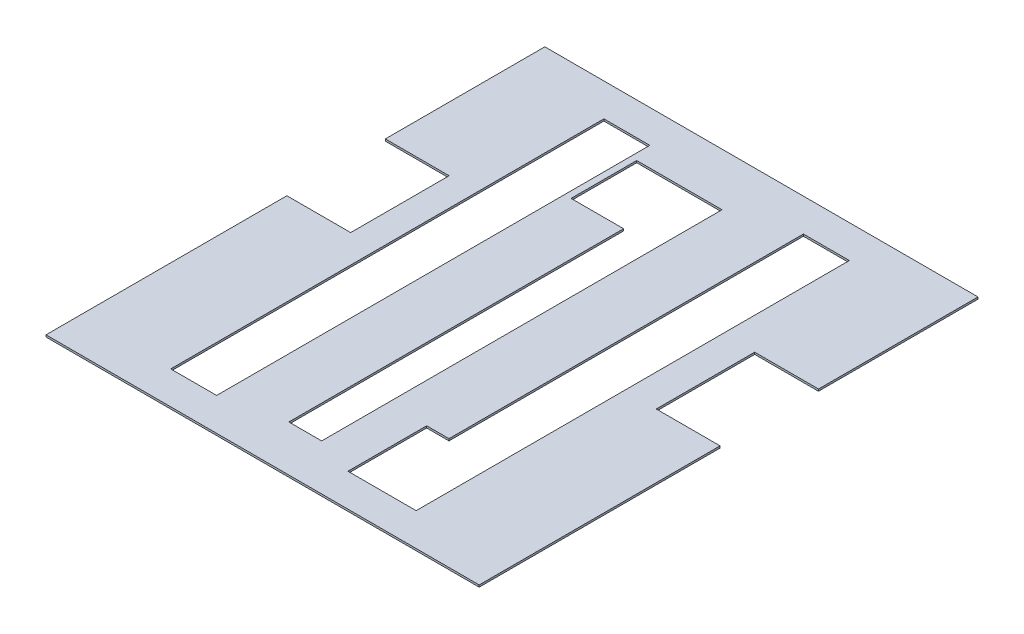
ISO-10303-21;
HEADER;
FILE_DESCRIPTION(('STEP AP214'),'2;1');
FILE_NAME('part.step','',(''),(''),'','','');
FILE_SCHEMA(('AUTOMOTIVE_DESIGN { 1 0 10303 214 1 1 1 1 }'));
ENDSEC;
DATA;
#1=APPLICATION_CONTEXT('core data for automotive mechanical design processes');
#2=APPLICATION_PROTOCOL_DEFINITION('international standard','automotive_design',2000,#1);
#3=PRODUCT_CONTEXT('',#1,'mechanical');
#4=PRODUCT('Part','Part','',(#3));
#5=PRODUCT_RELATED_PRODUCT_CATEGORY('part','',(#4));
#6=PRODUCT_DEFINITION_FORMATION('','',#4);
#7=PRODUCT_DEFINITION_CONTEXT('part definition',#1,'design');
#8=PRODUCT_DEFINITION('design','',#6,#7);
#9=PRODUCT_DEFINITION_SHAPE('','',#8);
#10=(LENGTH_UNIT() NAMED_UNIT(*) SI_UNIT(.MILLI.,.METRE.));
#11=(NAMED_UNIT(*) PLANE_ANGLE_UNIT() SI_UNIT($,.RADIAN.));
#12=(NAMED_UNIT(*) SI_UNIT($,.STERADIAN.) SOLID_ANGLE_UNIT());
#13=UNCERTAINTY_MEASURE_WITH_UNIT(LENGTH_MEASURE(1.E-05),#10,'distance_accuracy_value','');
#14=(GEOMETRIC_REPRESENTATION_CONTEXT(3) GLOBAL_UNCERTAINTY_ASSIGNED_CONTEXT((#13)) GLOBAL_UNIT_ASSIGNED_CONTEXT((#10,
#11,#12)) REPRESENTATION_CONTEXT('',''));
#15=CARTESIAN_POINT('',(0.,0.,0.));
#16=DIRECTION('',(0.,0.,1.));
#17=DIRECTION('',(1.,0.,0.));
#18=AXIS2_PLACEMENT_3D('',#15,#16,#17);
#19=CARTESIAN_POINT('',(6011.08406699949,1.5,8572.31237778607));
#20=DIRECTION('',(1.,0.,0.));
#21=DIRECTION('',(0.,0.,-1.));
#22=AXIS2_PLACEMENT_3D('',#19,#20,#21);
#23=PLANE('',#22);
#24=DIRECTION('',(0.,0.,1.));
#25=VECTOR('',#24,1.);
#26=CARTESIAN_POINT('',(6011.08406699949,1.5,8572.31237778607));
#27=LINE('',#26,#25);
#28=CARTESIAN_POINT('',(6011.08406699949,1.5,8768.81237778607));
#29=VERTEX_POINT('',#28);
#30=CARTESIAN_POINT('',(6011.08406699949,1.5,8952.31237778607));
#31=VERTEX_POINT('',#30);
#32=EDGE_CURVE('E341',#29,#31,#27,.T.);
#33=ORIENTED_EDGE('',*,*,#32,.F.);
#34=DIRECTION('',(0.,1.,0.));
#35=VECTOR('',#34,1.);
#36=CARTESIAN_POINT('',(6011.08406699949,-8.5,8768.81237778607));
#37=LINE('',#36,#35);
#38=CARTESIAN_POINT('',(6011.08406699949,0.,8768.81237778607));
#39=VERTEX_POINT('',#38);
#40=EDGE_CURVE('E316',#39,#29,#37,.T.);
#41=ORIENTED_EDGE('',*,*,#40,.F.);
#42=DIRECTION('',(0.,0.,1.));
#43=VECTOR('',#42,1.);
#44=CARTESIAN_POINT('',(6011.08406699949,0.,8572.31237778607));
#45=LINE('',#44,#43);
#46=CARTESIAN_POINT('',(6011.08406699949,0.,8952.31237778607));
#47=VERTEX_POINT('',#46);
#48=EDGE_CURVE('E315',#39,#47,#45,.T.);
#49=ORIENTED_EDGE('',*,*,#48,.T.);
#50=DIRECTION('',(0.,-1.,0.));
#51=VECTOR('',#50,1.);
#52=CARTESIAN_POINT('',(6011.08406699949,1.5,8952.31237778607));
#53=LINE('',#52,#51);
#54=EDGE_CURVE('E369',#31,#47,#53,.T.);
#55=ORIENTED_EDGE('',*,*,#54,.F.);
#56=EDGE_LOOP('',(#33,#41,#49,#55));
#57=FACE_BOUND('',#56,.T.);
#58=ADVANCED_FACE('F33',(#57),#23,.F.);
#59=CARTESIAN_POINT('',(6341.08406699949,1.5,8572.31237778607));
#60=DIRECTION('',(-1.,0.,0.));
#61=DIRECTION('',(0.,0.,1.));
#62=AXIS2_PLACEMENT_3D('',#59,#60,#61);
#63=PLANE('',#62);
#64=DIRECTION('',(0.,0.,-1.));
#65=VECTOR('',#64,1.);
#66=CARTESIAN_POINT('',(6341.08406699949,0.,8572.31237778607));
#67=LINE('',#66,#65);
#68=CARTESIAN_POINT('',(6341.08406699949,0.,8952.31237778607));
#69=VERTEX_POINT('',#68);
#70=CARTESIAN_POINT('',(6341.08406699949,0.,8768.81237778607));
#71=VERTEX_POINT('',#70);
#72=EDGE_CURVE('E356',#69,#71,#67,.T.);
#73=ORIENTED_EDGE('',*,*,#72,.T.);
#74=DIRECTION('',(0.,1.,0.));
#75=VECTOR('',#74,1.);
#76=CARTESIAN_POINT('',(6341.08406699949,-8.5,8768.81237778607));
#77=LINE('',#76,#75);
#78=CARTESIAN_POINT('',(6341.08406699949,1.5,8768.81237778607));
#79=VERTEX_POINT('',#78);
#80=EDGE_CURVE('E307',#71,#79,#77,.T.);
#81=ORIENTED_EDGE('',*,*,#80,.T.);
#82=DIRECTION('',(0.,0.,-1.));
#83=VECTOR('',#82,1.);
#84=CARTESIAN_POINT('',(6341.08406699949,1.5,8572.31237778607));
#85=LINE('',#84,#83);
#86=CARTESIAN_POINT('',(6341.08406699949,1.5,8952.31237778607));
#87=VERTEX_POINT('',#86);
#88=EDGE_CURVE('E344',#87,#79,#85,.T.);
#89=ORIENTED_EDGE('',*,*,#88,.F.);
#90=DIRECTION('',(0.,-1.,0.));
#91=VECTOR('',#90,1.);
#92=CARTESIAN_POINT('',(6341.08406699949,1.5,8952.31237778607));
#93=LINE('',#92,#91);
#94=EDGE_CURVE('E366',#87,#69,#93,.T.);
#95=ORIENTED_EDGE('',*,*,#94,.T.);
#96=EDGE_LOOP('',(#73,#81,#89,#95));
#97=FACE_BOUND('',#96,.T.);
#98=ADVANCED_FACE('F457',(#97),#63,.F.);
#99=CARTESIAN_POINT('',(6011.08406699949,0.,8572.31237778607));
#100=VERTEX_POINT('',#99);
#101=CARTESIAN_POINT('',(6011.08406699949,0.,8693.81237778607));
#102=VERTEX_POINT('',#101);
#103=EDGE_CURVE('E350',#100,#102,#45,.T.);
#104=ORIENTED_EDGE('',*,*,#103,.T.);
#105=DIRECTION('',(0.,1.,0.));
#106=VECTOR('',#105,1.);
#107=CARTESIAN_POINT('',(6011.08406699949,-8.5,8693.81237778607));
#108=LINE('',#107,#106);
#109=CARTESIAN_POINT('',(6011.08406699949,1.5,8693.81237778607));
#110=VERTEX_POINT('',#109);
#111=EDGE_CURVE('E318',#102,#110,#108,.T.);
#112=ORIENTED_EDGE('',*,*,#111,.T.);
#113=CARTESIAN_POINT('',(6011.08406699949,1.5,8572.31237778607));
#114=VERTEX_POINT('',#113);
#115=EDGE_CURVE('E337',#114,#110,#27,.T.);
#116=ORIENTED_EDGE('',*,*,#115,.F.);
#117=DIRECTION('',(0.,-1.,0.));
#118=VECTOR('',#117,1.);
#119=CARTESIAN_POINT('',(6011.08406699949,1.5,8572.31237778607));
#120=LINE('',#119,#118);
#121=EDGE_CURVE('E349',#114,#100,#120,.T.);
#122=ORIENTED_EDGE('',*,*,#121,.T.);
#123=EDGE_LOOP('',(#104,#112,#116,#122));
#124=FACE_BOUND('',#123,.T.);
#125=ADVANCED_FACE('F35',(#124),#23,.F.);
#126=CARTESIAN_POINT('',(6011.08406699949,1.5,8952.31237778607));
#127=DIRECTION('',(0.,0.,-1.));
#128=DIRECTION('',(-1.,0.,0.));
#129=AXIS2_PLACEMENT_3D('',#126,#127,#128);
#130=PLANE('',#129);
#131=DIRECTION('',(1.,0.,0.));
#132=VECTOR('',#131,1.);
#133=CARTESIAN_POINT('',(6011.08406699949,0.,8952.31237778607));
#134=LINE('',#133,#132);
#135=EDGE_CURVE('E353',#47,#69,#134,.T.);
#136=ORIENTED_EDGE('',*,*,#135,.T.);
#137=ORIENTED_EDGE('',*,*,#94,.F.);
#138=DIRECTION('',(1.,0.,0.));
#139=VECTOR('',#138,1.);
#140=CARTESIAN_POINT('',(6011.08406699949,1.5,8952.31237778607));
#141=LINE('',#140,#139);
#142=EDGE_CURVE('E340',#31,#87,#141,.T.);
#143=ORIENTED_EDGE('',*,*,#142,.F.);
#144=ORIENTED_EDGE('',*,*,#54,.T.);
#145=EDGE_LOOP('',(#136,#137,#143,#144));
#146=FACE_BOUND('',#145,.T.);
#147=ADVANCED_FACE('F467',(#146),#130,.F.);
#148=CARTESIAN_POINT('',(6341.08406699949,1.5,8693.81237778607));
#149=VERTEX_POINT('',#148);
#150=CARTESIAN_POINT('',(6341.08406699949,1.5,8572.31237778607));
#151=VERTEX_POINT('',#150);
#152=EDGE_CURVE('E343',#149,#151,#85,.T.);
#153=ORIENTED_EDGE('',*,*,#152,.F.);
#154=DIRECTION('',(0.,1.,0.));
#155=VECTOR('',#154,1.);
#156=CARTESIAN_POINT('',(6341.08406699949,-8.5,8693.81237778607));
#157=LINE('',#156,#155);
#158=CARTESIAN_POINT('',(6341.08406699949,0.,8693.81237778607));
#159=VERTEX_POINT('',#158);
#160=EDGE_CURVE('E329',#159,#149,#157,.T.);
#161=ORIENTED_EDGE('',*,*,#160,.F.);
#162=CARTESIAN_POINT('',(6341.08406699949,0.,8572.31237778607));
#163=VERTEX_POINT('',#162);
#164=EDGE_CURVE('E355',#159,#163,#67,.T.);
#165=ORIENTED_EDGE('',*,*,#164,.T.);
#166=DIRECTION('',(0.,-1.,0.));
#167=VECTOR('',#166,1.);
#168=CARTESIAN_POINT('',(6341.08406699949,1.5,8572.31237778607));
#169=LINE('',#168,#167);
#170=EDGE_CURVE('E363',#151,#163,#169,.T.);
#171=ORIENTED_EDGE('',*,*,#170,.F.);
#172=EDGE_LOOP('',(#153,#161,#165,#171));
#173=FACE_BOUND('',#172,.T.);
#174=ADVANCED_FACE('F464',(#173),#63,.F.);
#175=CARTESIAN_POINT('',(6011.08406699949,1.5,8572.31237778607));
#176=DIRECTION('',(0.,0.,1.));
#177=DIRECTION('',(1.,0.,0.));
#178=AXIS2_PLACEMENT_3D('',#175,#176,#177);
#179=PLANE('',#178);
#180=DIRECTION('',(-1.,0.,0.));
#181=VECTOR('',#180,1.);
#182=CARTESIAN_POINT('',(6011.08406699949,0.,8572.31237778607));
#183=LINE('',#182,#181);
#184=EDGE_CURVE('E359',#163,#100,#183,.T.);
#185=ORIENTED_EDGE('',*,*,#184,.T.);
#186=ORIENTED_EDGE('',*,*,#121,.F.);
#187=DIRECTION('',(-1.,0.,0.));
#188=VECTOR('',#187,1.);
#189=CARTESIAN_POINT('',(6011.08406699949,1.5,8572.31237778607));
#190=LINE('',#189,#188);
#191=EDGE_CURVE('E347',#151,#114,#190,.T.);
#192=ORIENTED_EDGE('',*,*,#191,.F.);
#193=ORIENTED_EDGE('',*,*,#170,.T.);
#194=EDGE_LOOP('',(#185,#186,#192,#193));
#195=FACE_BOUND('',#194,.T.);
#196=ADVANCED_FACE('F495',(#195),#179,.F.);
#197=CARTESIAN_POINT('',(0.,1.5,0.));
#198=DIRECTION('',(0.,1.,0.));
#199=DIRECTION('',(0.,0.,1.));
#200=AXIS2_PLACEMENT_3D('',#197,#198,#199);
#201=PLANE('',#200);
#202=DIRECTION('',(1.,0.,0.));
#203=VECTOR('',#202,1.);
#204=CARTESIAN_POINT('',(6268.08406699949,1.5,8927.31237778607));
#205=LINE('',#204,#203);
#206=CARTESIAN_POINT('',(6216.08406699949,1.5,8927.31237778607));
#207=VERTEX_POINT('',#206);
#208=CARTESIAN_POINT('',(6268.08406699949,1.5,8927.31237778607));
#209=VERTEX_POINT('',#208);
#210=EDGE_CURVE('E239',#207,#209,#205,.T.);
#211=ORIENTED_EDGE('',*,*,#210,.F.);
#212=DIRECTION('',(0.,0.,1.));
#213=VECTOR('',#212,1.);
#214=CARTESIAN_POINT('',(6216.08406699949,1.5,8927.31237778607));
#215=LINE('',#214,#213);
#216=CARTESIAN_POINT('',(6216.08406699949,1.5,8867.31237778607));
#217=VERTEX_POINT('',#216);
#218=EDGE_CURVE('E234',#217,#207,#215,.T.);
#219=ORIENTED_EDGE('',*,*,#218,.F.);
#220=DIRECTION('',(-1.,0.,0.));
#221=VECTOR('',#220,1.);
#222=CARTESIAN_POINT('',(6233.08406699949,1.5,8867.31237778607));
#223=LINE('',#222,#221);
#224=CARTESIAN_POINT('',(6233.08406699949,1.5,8867.31237778607));
#225=VERTEX_POINT('',#224);
#226=EDGE_CURVE('E220',#225,#217,#223,.T.);
#227=ORIENTED_EDGE('',*,*,#226,.F.);
#228=DIRECTION('',(0.,0.,1.));
#229=VECTOR('',#228,1.);
#230=CARTESIAN_POINT('',(6233.08406699949,1.5,8927.31237778607));
#231=LINE('',#230,#229);
#232=CARTESIAN_POINT('',(6233.08406699949,1.5,8597.31237778607));
#233=VERTEX_POINT('',#232);
#234=EDGE_CURVE('E232',#233,#225,#231,.T.);
#235=ORIENTED_EDGE('',*,*,#234,.F.);
#236=DIRECTION('',(-1.,0.,0.));
#237=VECTOR('',#236,1.);
#238=CARTESIAN_POINT('',(6268.08406699949,1.5,8597.31237778607));
#239=LINE('',#238,#237);
#240=CARTESIAN_POINT('',(6268.08406699949,1.5,8597.31237778607));
#241=VERTEX_POINT('',#240);
#242=EDGE_CURVE('E240',#241,#233,#239,.T.);
#243=ORIENTED_EDGE('',*,*,#242,.F.);
#244=DIRECTION('',(0.,0.,-1.));
#245=VECTOR('',#244,1.);
#246=CARTESIAN_POINT('',(6268.08406699949,1.5,8927.31237778607));
#247=LINE('',#246,#245);
#248=EDGE_CURVE('E56',#209,#241,#247,.T.);
#249=ORIENTED_EDGE('',*,*,#248,.F.);
#250=EDGE_LOOP('',(#211,#219,#227,#235,#243,#249));
#251=FACE_BOUND('',#250,.T.);
#252=DIRECTION('',(0.,0.,1.));
#253=VECTOR('',#252,1.);
#254=CARTESIAN_POINT('',(6081.08406699949,1.5,8597.31237778608));
#255=LINE('',#254,#253);
#256=CARTESIAN_POINT('',(6081.08406699949,1.5,8597.31237778608));
#257=VERTEX_POINT('',#256);
#258=CARTESIAN_POINT('',(6081.08406699949,1.5,8927.31237778607));
#259=VERTEX_POINT('',#258);
#260=EDGE_CURVE('E253',#257,#259,#255,.T.);
#261=ORIENTED_EDGE('',*,*,#260,.F.);
#262=DIRECTION('',(-1.,0.,0.));
#263=VECTOR('',#262,1.);
#264=CARTESIAN_POINT('',(6081.08406699949,1.5,8597.31237778608));
#265=LINE('',#264,#263);
#266=CARTESIAN_POINT('',(6116.08406699949,1.5,8597.31237778608));
#267=VERTEX_POINT('',#266);
#268=EDGE_CURVE('E262',#267,#257,#265,.T.);
#269=ORIENTED_EDGE('',*,*,#268,.F.);
#270=DIRECTION('',(0.,0.,-1.));
#271=VECTOR('',#270,1.);
#272=CARTESIAN_POINT('',(6116.08406699949,1.5,8597.31237778608));
#273=LINE('',#272,#271);
#274=CARTESIAN_POINT('',(6116.08406699949,1.5,8927.31237778607));
#275=VERTEX_POINT('',#274);
#276=EDGE_CURVE('E259',#275,#267,#273,.T.);
#277=ORIENTED_EDGE('',*,*,#276,.F.);
#278=DIRECTION('',(1.,0.,0.));
#279=VECTOR('',#278,1.);
#280=CARTESIAN_POINT('',(6081.08406699949,1.5,8927.31237778607));
#281=LINE('',#280,#279);
#282=EDGE_CURVE('E255',#259,#275,#281,.T.);
#283=ORIENTED_EDGE('',*,*,#282,.F.);
#284=EDGE_LOOP('',(#261,#269,#277,#283));
#285=FACE_BOUND('',#284,.T.);
#286=DIRECTION('',(0.,0.,1.));
#287=VECTOR('',#286,1.);
#288=CARTESIAN_POINT('',(6121.08406699949,1.5,8612.31237778607));
#289=LINE('',#288,#287);
#290=CARTESIAN_POINT('',(6121.08406699949,1.5,8612.31237778607));
#291=VERTEX_POINT('',#290);
#292=CARTESIAN_POINT('',(6121.08406699949,1.5,8662.31237778607));
#293=VERTEX_POINT('',#292);
#294=EDGE_CURVE('E274',#291,#293,#289,.T.);
#295=ORIENTED_EDGE('',*,*,#294,.F.);
#296=DIRECTION('',(-1.,0.,0.));
#297=VECTOR('',#296,1.);
#298=CARTESIAN_POINT('',(6121.08406699949,1.5,8612.31237778607));
#299=LINE('',#298,#297);
#300=CARTESIAN_POINT('',(6186.08406699949,1.5,8612.31237778607));
#301=VERTEX_POINT('',#300);
#302=EDGE_CURVE('E288',#301,#291,#299,.T.);
#303=ORIENTED_EDGE('',*,*,#302,.F.);
#304=DIRECTION('',(0.,0.,-1.));
#305=VECTOR('',#304,1.);
#306=CARTESIAN_POINT('',(6186.08406699949,1.5,8612.31237778607));
#307=LINE('',#306,#305);
#308=CARTESIAN_POINT('',(6186.08406699949,1.5,8917.31237778607));
#309=VERTEX_POINT('',#308);
#310=EDGE_CURVE('E285',#309,#301,#307,.T.);
#311=ORIENTED_EDGE('',*,*,#310,.F.);
#312=DIRECTION('',(1.,0.,0.));
#313=VECTOR('',#312,1.);
#314=CARTESIAN_POINT('',(6161.08406699949,1.5,8917.31237778607));
#315=LINE('',#314,#313);
#316=CARTESIAN_POINT('',(6161.08406699949,1.5,8917.31237778607));
#317=VERTEX_POINT('',#316);
#318=EDGE_CURVE('E282',#317,#309,#315,.T.);
#319=ORIENTED_EDGE('',*,*,#318,.F.);
#320=DIRECTION('',(0.,0.,1.));
#321=VECTOR('',#320,1.);
#322=CARTESIAN_POINT('',(6161.08406699949,1.5,8662.31237778607));
#323=LINE('',#322,#321);
#324=CARTESIAN_POINT('',(6161.08406699949,1.5,8662.31237778607));
#325=VERTEX_POINT('',#324);
#326=EDGE_CURVE('E279',#325,#317,#323,.T.);
#327=ORIENTED_EDGE('',*,*,#326,.F.);
#328=DIRECTION('',(1.,0.,0.));
#329=VECTOR('',#328,1.);
#330=CARTESIAN_POINT('',(6161.08406699949,1.5,8662.31237778607));
#331=LINE('',#330,#329);
#332=EDGE_CURVE('E276',#293,#325,#331,.T.);
#333=ORIENTED_EDGE('',*,*,#332,.F.);
#334=EDGE_LOOP('',(#295,#303,#311,#319,#327,#333));
#335=FACE_BOUND('',#334,.T.);
#336=DIRECTION('',(1.,0.,0.));
#337=VECTOR('',#336,1.);
#338=CARTESIAN_POINT('',(6059.68406699949,1.5,8768.81237778607));
#339=LINE('',#338,#337);
#340=CARTESIAN_POINT('',(6059.68406699949,1.5,8768.81237778607));
#341=VERTEX_POINT('',#340);
#342=EDGE_CURVE('E309',#29,#341,#339,.T.);
#343=ORIENTED_EDGE('',*,*,#342,.F.);
#344=ORIENTED_EDGE('',*,*,#32,.T.);
#345=ORIENTED_EDGE('',*,*,#142,.T.);
#346=ORIENTED_EDGE('',*,*,#88,.T.);
#347=DIRECTION('',(1.,0.,0.));
#348=VECTOR('',#347,1.);
#349=CARTESIAN_POINT('',(6341.08406699949,1.5,8768.81237778607));
#350=LINE('',#349,#348);
#351=CARTESIAN_POINT('',(6292.48406699949,1.5,8768.81237778607));
#352=VERTEX_POINT('',#351);
#353=EDGE_CURVE('E327',#352,#79,#350,.T.);
#354=ORIENTED_EDGE('',*,*,#353,.F.);
#355=DIRECTION('',(0.,0.,1.));
#356=VECTOR('',#355,1.);
#357=CARTESIAN_POINT('',(6292.48406699949,1.5,8768.81237778607));
#358=LINE('',#357,#356);
#359=CARTESIAN_POINT('',(6292.48406699949,1.5,8693.81237778607));
#360=VERTEX_POINT('',#359);
#361=EDGE_CURVE('E324',#360,#352,#358,.T.);
#362=ORIENTED_EDGE('',*,*,#361,.F.);
#363=DIRECTION('',(-1.,0.,0.));
#364=VECTOR('',#363,1.);
#365=CARTESIAN_POINT('',(6341.08406699949,1.5,8693.81237778607));
#366=LINE('',#365,#364);
#367=EDGE_CURVE('E250',#149,#360,#366,.T.);
#368=ORIENTED_EDGE('',*,*,#367,.F.);
#369=ORIENTED_EDGE('',*,*,#152,.T.);
#370=ORIENTED_EDGE('',*,*,#191,.T.);
#371=ORIENTED_EDGE('',*,*,#115,.T.);
#372=DIRECTION('',(-1.,0.,0.));
#373=VECTOR('',#372,1.);
#374=CARTESIAN_POINT('',(6059.68406699949,1.5,8693.81237778607));
#375=LINE('',#374,#373);
#376=CARTESIAN_POINT('',(6059.68406699949,1.5,8693.81237778607));
#377=VERTEX_POINT('',#376);
#378=EDGE_CURVE('E306',#377,#110,#375,.T.);
#379=ORIENTED_EDGE('',*,*,#378,.F.);
#380=DIRECTION('',(0.,0.,-1.));
#381=VECTOR('',#380,1.);
#382=CARTESIAN_POINT('',(6059.68406699949,1.5,8768.81237778607));
#383=LINE('',#382,#381);
#384=EDGE_CURVE('E303',#341,#377,#383,.T.);
#385=ORIENTED_EDGE('',*,*,#384,.F.);
#386=EDGE_LOOP('',(#343,#344,#345,#346,#354,#362,#368,#369,#370,#371,#379,#385));
#387=FACE_BOUND('',#386,.T.);
#388=ADVANCED_FACE('F229',(#251,#285,#335,#387),#201,.T.);
#389=CARTESIAN_POINT('',(0.,0.,0.));
#390=DIRECTION('',(0.,1.,0.));
#391=DIRECTION('',(0.,0.,1.));
#392=AXIS2_PLACEMENT_3D('',#389,#390,#391);
#393=PLANE('',#392);
#394=DIRECTION('',(0.,0.,1.));
#395=VECTOR('',#394,1.);
#396=CARTESIAN_POINT('',(6216.08406699949,0.,0.));
#397=LINE('',#396,#395);
#398=CARTESIAN_POINT('',(6216.08406699949,0.,8867.31237778607));
#399=VERTEX_POINT('',#398);
#400=CARTESIAN_POINT('',(6216.08406699949,0.,8927.31237778607));
#401=VERTEX_POINT('',#400);
#402=EDGE_CURVE('E11',#399,#401,#397,.T.);
#403=ORIENTED_EDGE('',*,*,#402,.T.);
#404=DIRECTION('',(1.,0.,0.));
#405=VECTOR('',#404,1.);
#406=CARTESIAN_POINT('',(0.,0.,8927.31237778607));
#407=LINE('',#406,#405);
#408=CARTESIAN_POINT('',(6268.08406699949,0.,8927.31237778607));
#409=VERTEX_POINT('',#408);
#410=EDGE_CURVE('E425',#401,#409,#407,.T.);
#411=ORIENTED_EDGE('',*,*,#410,.T.);
#412=DIRECTION('',(0.,0.,-1.));
#413=VECTOR('',#412,1.);
#414=CARTESIAN_POINT('',(6268.08406699949,0.,0.));
#415=LINE('',#414,#413);
#416=CARTESIAN_POINT('',(6268.08406699949,0.,8597.31237778607));
#417=VERTEX_POINT('',#416);
#418=EDGE_CURVE('E226',#409,#417,#415,.T.);
#419=ORIENTED_EDGE('',*,*,#418,.T.);
#420=DIRECTION('',(-1.,0.,0.));
#421=VECTOR('',#420,1.);
#422=CARTESIAN_POINT('',(0.,0.,8597.31237778607));
#423=LINE('',#422,#421);
#424=CARTESIAN_POINT('',(6233.08406699949,0.,8597.31237778607));
#425=VERTEX_POINT('',#424);
#426=EDGE_CURVE('E420',#417,#425,#423,.T.);
#427=ORIENTED_EDGE('',*,*,#426,.T.);
#428=DIRECTION('',(0.,0.,1.));
#429=VECTOR('',#428,1.);
#430=CARTESIAN_POINT('',(6233.08406699951,0.,1.6776032595411E-11));
#431=LINE('',#430,#429);
#432=CARTESIAN_POINT('',(6233.08406699949,0.,8867.31237778607));
#433=VERTEX_POINT('',#432);
#434=EDGE_CURVE('E423',#425,#433,#431,.T.);
#435=ORIENTED_EDGE('',*,*,#434,.T.);
#436=DIRECTION('',(-1.,0.,0.));
#437=VECTOR('',#436,1.);
#438=CARTESIAN_POINT('',(0.,0.,8867.31237778607));
#439=LINE('',#438,#437);
#440=EDGE_CURVE('E48',#433,#399,#439,.T.);
#441=ORIENTED_EDGE('',*,*,#440,.T.);
#442=EDGE_LOOP('',(#403,#411,#419,#427,#435,#441));
#443=FACE_BOUND('',#442,.T.);
#444=DIRECTION('',(-1.,0.,0.));
#445=VECTOR('',#444,1.);
#446=CARTESIAN_POINT('',(0.,0.,8597.31237778608));
#447=LINE('',#446,#445);
#448=CARTESIAN_POINT('',(6116.08406699949,0.,8597.31237778608));
#449=VERTEX_POINT('',#448);
#450=CARTESIAN_POINT('',(6081.08406699949,0.,8597.31237778608));
#451=VERTEX_POINT('',#450);
#452=EDGE_CURVE('E414',#449,#451,#447,.T.);
#453=ORIENTED_EDGE('',*,*,#452,.T.);
#454=DIRECTION('',(0.,0.,1.));
#455=VECTOR('',#454,1.);
#456=CARTESIAN_POINT('',(6081.08406699949,0.,0.));
#457=LINE('',#456,#455);
#458=CARTESIAN_POINT('',(6081.08406699949,0.,8927.31237778607));
#459=VERTEX_POINT('',#458);
#460=EDGE_CURVE('E417',#451,#459,#457,.T.);
#461=ORIENTED_EDGE('',*,*,#460,.T.);
#462=DIRECTION('',(1.,0.,0.));
#463=VECTOR('',#462,1.);
#464=CARTESIAN_POINT('',(0.,0.,8927.31237778607));
#465=LINE('',#464,#463);
#466=CARTESIAN_POINT('',(6116.08406699949,0.,8927.31237778607));
#467=VERTEX_POINT('',#466);
#468=EDGE_CURVE('E408',#459,#467,#465,.T.);
#469=ORIENTED_EDGE('',*,*,#468,.T.);
#470=DIRECTION('',(0.,0.,-1.));
#471=VECTOR('',#470,1.);
#472=CARTESIAN_POINT('',(6116.08406699949,0.,0.));
#473=LINE('',#472,#471);
#474=EDGE_CURVE('E411',#467,#449,#473,.T.);
#475=ORIENTED_EDGE('',*,*,#474,.T.);
#476=EDGE_LOOP('',(#453,#461,#469,#475));
#477=FACE_BOUND('',#476,.T.);
#478=DIRECTION('',(-1.,0.,0.));
#479=VECTOR('',#478,1.);
#480=CARTESIAN_POINT('',(0.,0.,8612.31237778607));
#481=LINE('',#480,#479);
#482=CARTESIAN_POINT('',(6186.08406699949,0.,8612.31237778607));
#483=VERTEX_POINT('',#482);
#484=CARTESIAN_POINT('',(6121.08406699949,0.,8612.31237778607));
#485=VERTEX_POINT('',#484);
#486=EDGE_CURVE('E402',#483,#485,#481,.T.);
#487=ORIENTED_EDGE('',*,*,#486,.T.);
#488=DIRECTION('',(0.,0.,1.));
#489=VECTOR('',#488,1.);
#490=CARTESIAN_POINT('',(6121.08406699949,0.,0.));
#491=LINE('',#490,#489);
#492=CARTESIAN_POINT('',(6121.08406699949,0.,8662.31237778607));
#493=VERTEX_POINT('',#492);
#494=EDGE_CURVE('E405',#485,#493,#491,.T.);
#495=ORIENTED_EDGE('',*,*,#494,.T.);
#496=DIRECTION('',(1.,0.,0.));
#497=VECTOR('',#496,1.);
#498=CARTESIAN_POINT('',(0.,0.,8662.31237778607));
#499=LINE('',#498,#497);
#500=CARTESIAN_POINT('',(6161.08406699949,0.,8662.31237778607));
#501=VERTEX_POINT('',#500);
#502=EDGE_CURVE('E390',#493,#501,#499,.T.);
#503=ORIENTED_EDGE('',*,*,#502,.T.);
#504=DIRECTION('',(0.,0.,1.));
#505=VECTOR('',#504,1.);
#506=CARTESIAN_POINT('',(6161.08406699949,0.,0.));
#507=LINE('',#506,#505);
#508=CARTESIAN_POINT('',(6161.08406699949,0.,8917.31237778607));
#509=VERTEX_POINT('',#508);
#510=EDGE_CURVE('E393',#501,#509,#507,.T.);
#511=ORIENTED_EDGE('',*,*,#510,.T.);
#512=DIRECTION('',(1.,0.,0.));
#513=VECTOR('',#512,1.);
#514=CARTESIAN_POINT('',(0.,0.,8917.31237778607));
#515=LINE('',#514,#513);
#516=CARTESIAN_POINT('',(6186.08406699949,0.,8917.31237778607));
#517=VERTEX_POINT('',#516);
#518=EDGE_CURVE('E396',#509,#517,#515,.T.);
#519=ORIENTED_EDGE('',*,*,#518,.T.);
#520=DIRECTION('',(0.,0.,-1.));
#521=VECTOR('',#520,1.);
#522=CARTESIAN_POINT('',(6186.08406699949,0.,0.));
#523=LINE('',#522,#521);
#524=EDGE_CURVE('E399',#517,#483,#523,.T.);
#525=ORIENTED_EDGE('',*,*,#524,.T.);
#526=EDGE_LOOP('',(#487,#495,#503,#511,#519,#525));
#527=FACE_BOUND('',#526,.T.);
#528=ORIENTED_EDGE('',*,*,#48,.F.);
#529=DIRECTION('',(1.,0.,0.));
#530=VECTOR('',#529,1.);
#531=CARTESIAN_POINT('',(0.,0.,8768.81237778607));
#532=LINE('',#531,#530);
#533=CARTESIAN_POINT('',(6059.68406699949,0.,8768.81237778607));
#534=VERTEX_POINT('',#533);
#535=EDGE_CURVE('E387',#39,#534,#532,.T.);
#536=ORIENTED_EDGE('',*,*,#535,.T.);
#537=DIRECTION('',(0.,0.,-1.));
#538=VECTOR('',#537,1.);
#539=CARTESIAN_POINT('',(6059.68406699959,0.,7.17610749134637E-11));
#540=LINE('',#539,#538);
#541=CARTESIAN_POINT('',(6059.68406699949,0.,8693.81237778607));
#542=VERTEX_POINT('',#541);
#543=EDGE_CURVE('E384',#534,#542,#540,.T.);
#544=ORIENTED_EDGE('',*,*,#543,.T.);
#545=DIRECTION('',(-1.,0.,0.));
#546=VECTOR('',#545,1.);
#547=CARTESIAN_POINT('',(0.,0.,8693.81237778607));
#548=LINE('',#547,#546);
#549=EDGE_CURVE('E381',#542,#102,#548,.T.);
#550=ORIENTED_EDGE('',*,*,#549,.T.);
#551=ORIENTED_EDGE('',*,*,#103,.F.);
#552=ORIENTED_EDGE('',*,*,#184,.F.);
#553=ORIENTED_EDGE('',*,*,#164,.F.);
#554=DIRECTION('',(-1.,0.,0.));
#555=VECTOR('',#554,1.);
#556=CARTESIAN_POINT('',(0.,0.,8693.81237778607));
#557=LINE('',#556,#555);
#558=CARTESIAN_POINT('',(6292.48406699949,0.,8693.81237778607));
#559=VERTEX_POINT('',#558);
#560=EDGE_CURVE('E372',#159,#559,#557,.T.);
#561=ORIENTED_EDGE('',*,*,#560,.T.);
#562=DIRECTION('',(0.,0.,1.));
#563=VECTOR('',#562,1.);
#564=CARTESIAN_POINT('',(6292.48406699949,0.,0.));
#565=LINE('',#564,#563);
#566=CARTESIAN_POINT('',(6292.48406699949,0.,8768.81237778607));
#567=VERTEX_POINT('',#566);
#568=EDGE_CURVE('E375',#559,#567,#565,.T.);
#569=ORIENTED_EDGE('',*,*,#568,.T.);
#570=DIRECTION('',(1.,0.,0.));
#571=VECTOR('',#570,1.);
#572=CARTESIAN_POINT('',(0.,0.,8768.81237778607));
#573=LINE('',#572,#571);
#574=EDGE_CURVE('E378',#567,#71,#573,.T.);
#575=ORIENTED_EDGE('',*,*,#574,.T.);
#576=ORIENTED_EDGE('',*,*,#72,.F.);
#577=ORIENTED_EDGE('',*,*,#135,.F.);
#578=EDGE_LOOP('',(#528,#536,#544,#550,#551,#552,#553,#561,#569,#575,#576,#577));
#579=FACE_BOUND('',#578,.T.);
#580=ADVANCED_FACE('F430',(#443,#477,#527,#579),#393,.F.);
#581=CARTESIAN_POINT('',(6341.08406699949,-8.5,8768.81237778607));
#582=DIRECTION('',(0.,0.,1.));
#583=DIRECTION('',(1.,0.,0.));
#584=AXIS2_PLACEMENT_3D('',#581,#582,#583);
#585=PLANE('',#584);
#586=DIRECTION('',(0.,1.,0.));
#587=VECTOR('',#586,1.);
#588=CARTESIAN_POINT('',(6292.48406699949,-8.5,8768.81237778607));
#589=LINE('',#588,#587);
#590=EDGE_CURVE('E332',#567,#352,#589,.T.);
#591=ORIENTED_EDGE('',*,*,#590,.T.);
#592=ORIENTED_EDGE('',*,*,#353,.T.);
#593=ORIENTED_EDGE('',*,*,#80,.F.);
#594=ORIENTED_EDGE('',*,*,#574,.F.);
#595=EDGE_LOOP('',(#591,#592,#593,#594));
#596=FACE_BOUND('',#595,.T.);
#597=ADVANCED_FACE('F507',(#596),#585,.F.);
#598=CARTESIAN_POINT('',(6292.48406699949,-8.5,8768.81237778607));
#599=DIRECTION('',(-1.,0.,0.));
#600=DIRECTION('',(0.,0.,1.));
#601=AXIS2_PLACEMENT_3D('',#598,#599,#600);
#602=PLANE('',#601);
#603=DIRECTION('',(0.,1.,0.));
#604=VECTOR('',#603,1.);
#605=CARTESIAN_POINT('',(6292.48406699949,-8.5,8693.81237778607));
#606=LINE('',#605,#604);
#607=EDGE_CURVE('E334',#559,#360,#606,.T.);
#608=ORIENTED_EDGE('',*,*,#607,.T.);
#609=ORIENTED_EDGE('',*,*,#361,.T.);
#610=ORIENTED_EDGE('',*,*,#590,.F.);
#611=ORIENTED_EDGE('',*,*,#568,.F.);
#612=EDGE_LOOP('',(#608,#609,#610,#611));
#613=FACE_BOUND('',#612,.T.);
#614=ADVANCED_FACE('F504',(#613),#602,.F.);
#615=CARTESIAN_POINT('',(6341.08406699949,-8.5,8693.81237778607));
#616=DIRECTION('',(0.,0.,-1.));
#617=DIRECTION('',(-1.,0.,0.));
#618=AXIS2_PLACEMENT_3D('',#615,#616,#617);
#619=PLANE('',#618);
#620=ORIENTED_EDGE('',*,*,#160,.T.);
#621=ORIENTED_EDGE('',*,*,#367,.T.);
#622=ORIENTED_EDGE('',*,*,#607,.F.);
#623=ORIENTED_EDGE('',*,*,#560,.F.);
#624=EDGE_LOOP('',(#620,#621,#622,#623));
#625=FACE_BOUND('',#624,.T.);
#626=ADVANCED_FACE('F500',(#625),#619,.F.);
#627=CARTESIAN_POINT('',(6059.68406699949,-8.5,8768.81237778607));
#628=DIRECTION('',(1.,0.,0.));
#629=DIRECTION('',(0.,0.,-1.));
#630=AXIS2_PLACEMENT_3D('',#627,#628,#629);
#631=PLANE('',#630);
#632=DIRECTION('',(0.,1.,0.));
#633=VECTOR('',#632,1.);
#634=CARTESIAN_POINT('',(6059.68406699949,-8.5,8768.81237778607));
#635=LINE('',#634,#633);
#636=EDGE_CURVE('E313',#534,#341,#635,.T.);
#637=ORIENTED_EDGE('',*,*,#636,.T.);
#638=ORIENTED_EDGE('',*,*,#384,.T.);
#639=DIRECTION('',(0.,1.,0.));
#640=VECTOR('',#639,1.);
#641=CARTESIAN_POINT('',(6059.68406699949,-8.5,8693.81237778607));
#642=LINE('',#641,#640);
#643=EDGE_CURVE('E312',#542,#377,#642,.T.);
#644=ORIENTED_EDGE('',*,*,#643,.F.);
#645=ORIENTED_EDGE('',*,*,#543,.F.);
#646=EDGE_LOOP('',(#637,#638,#644,#645));
#647=FACE_BOUND('',#646,.T.);
#648=ADVANCED_FACE('F484',(#647),#631,.F.);
#649=CARTESIAN_POINT('',(6059.68406699949,-8.5,8768.81237778607));
#650=DIRECTION('',(0.,0.,1.));
#651=DIRECTION('',(1.,0.,0.));
#652=AXIS2_PLACEMENT_3D('',#649,#650,#651);
#653=PLANE('',#652);
#654=ORIENTED_EDGE('',*,*,#40,.T.);
#655=ORIENTED_EDGE('',*,*,#342,.T.);
#656=ORIENTED_EDGE('',*,*,#636,.F.);
#657=ORIENTED_EDGE('',*,*,#535,.F.);
#658=EDGE_LOOP('',(#654,#655,#656,#657));
#659=FACE_BOUND('',#658,.T.);
#660=ADVANCED_FACE('F516',(#659),#653,.F.);
#661=CARTESIAN_POINT('',(6059.68406699949,-8.5,8693.81237778607));
#662=DIRECTION('',(0.,0.,-1.));
#663=DIRECTION('',(-1.,0.,0.));
#664=AXIS2_PLACEMENT_3D('',#661,#662,#663);
#665=PLANE('',#664);
#666=ORIENTED_EDGE('',*,*,#643,.T.);
#667=ORIENTED_EDGE('',*,*,#378,.T.);
#668=ORIENTED_EDGE('',*,*,#111,.F.);
#669=ORIENTED_EDGE('',*,*,#549,.F.);
#670=EDGE_LOOP('',(#666,#667,#668,#669));
#671=FACE_BOUND('',#670,.T.);
#672=ADVANCED_FACE('F482',(#671),#665,.F.);
#673=CARTESIAN_POINT('',(6121.08406699949,-8.5,8612.31237778607));
#674=DIRECTION('',(-1.,0.,0.));
#675=DIRECTION('',(0.,0.,1.));
#676=AXIS2_PLACEMENT_3D('',#673,#674,#675);
#677=PLANE('',#676);
#678=DIRECTION('',(0.,1.,0.));
#679=VECTOR('',#678,1.);
#680=CARTESIAN_POINT('',(6121.08406699949,-8.5,8612.31237778607));
#681=LINE('',#680,#679);
#682=EDGE_CURVE('E256',#485,#291,#681,.T.);
#683=ORIENTED_EDGE('',*,*,#682,.T.);
#684=ORIENTED_EDGE('',*,*,#294,.T.);
#685=DIRECTION('',(0.,1.,0.));
#686=VECTOR('',#685,1.);
#687=CARTESIAN_POINT('',(6121.08406699949,-8.5,8662.31237778607));
#688=LINE('',#687,#686);
#689=EDGE_CURVE('E291',#493,#293,#688,.T.);
#690=ORIENTED_EDGE('',*,*,#689,.F.);
#691=ORIENTED_EDGE('',*,*,#494,.F.);
#692=EDGE_LOOP('',(#683,#684,#690,#691));
#693=FACE_BOUND('',#692,.T.);
#694=ADVANCED_FACE('F523',(#693),#677,.F.);
#695=CARTESIAN_POINT('',(6121.08406699949,-8.5,8612.31237778607));
#696=DIRECTION('',(0.,0.,-1.));
#697=DIRECTION('',(-1.,0.,0.));
#698=AXIS2_PLACEMENT_3D('',#695,#696,#697);
#699=PLANE('',#698);
#700=DIRECTION('',(0.,1.,0.));
#701=VECTOR('',#700,1.);
#702=CARTESIAN_POINT('',(6186.08406699949,-8.5,8612.31237778607));
#703=LINE('',#702,#701);
#704=EDGE_CURVE('E293',#483,#301,#703,.T.);
#705=ORIENTED_EDGE('',*,*,#704,.T.);
#706=ORIENTED_EDGE('',*,*,#302,.T.);
#707=ORIENTED_EDGE('',*,*,#682,.F.);
#708=ORIENTED_EDGE('',*,*,#486,.F.);
#709=EDGE_LOOP('',(#705,#706,#707,#708));
#710=FACE_BOUND('',#709,.T.);
#711=ADVANCED_FACE('F594',(#710),#699,.F.);
#712=CARTESIAN_POINT('',(6186.08406699949,-8.5,8612.31237778607));
#713=DIRECTION('',(1.,0.,0.));
#714=DIRECTION('',(0.,0.,-1.));
#715=AXIS2_PLACEMENT_3D('',#712,#713,#714);
#716=PLANE('',#715);
#717=DIRECTION('',(0.,1.,0.));
#718=VECTOR('',#717,1.);
#719=CARTESIAN_POINT('',(6186.08406699949,-8.5,8917.31237778607));
#720=LINE('',#719,#718);
#721=EDGE_CURVE('E295',#517,#309,#720,.T.);
#722=ORIENTED_EDGE('',*,*,#721,.T.);
#723=ORIENTED_EDGE('',*,*,#310,.T.);
#724=ORIENTED_EDGE('',*,*,#704,.F.);
#725=ORIENTED_EDGE('',*,*,#524,.F.);
#726=EDGE_LOOP('',(#722,#723,#724,#725));
#727=FACE_BOUND('',#726,.T.);
#728=ADVANCED_FACE('F603',(#727),#716,.F.);
#729=CARTESIAN_POINT('',(6161.08406699949,-8.5,8917.31237778607));
#730=DIRECTION('',(0.,0.,1.));
#731=DIRECTION('',(1.,0.,0.));
#732=AXIS2_PLACEMENT_3D('',#729,#730,#731);
#733=PLANE('',#732);
#734=DIRECTION('',(0.,1.,0.));
#735=VECTOR('',#734,1.);
#736=CARTESIAN_POINT('',(6161.08406699949,-8.5,8917.31237778607));
#737=LINE('',#736,#735);
#738=EDGE_CURVE('E297',#509,#317,#737,.T.);
#739=ORIENTED_EDGE('',*,*,#738,.T.);
#740=ORIENTED_EDGE('',*,*,#318,.T.);
#741=ORIENTED_EDGE('',*,*,#721,.F.);
#742=ORIENTED_EDGE('',*,*,#518,.F.);
#743=EDGE_LOOP('',(#739,#740,#741,#742));
#744=FACE_BOUND('',#743,.T.);
#745=ADVANCED_FACE('F613',(#744),#733,.F.);
#746=CARTESIAN_POINT('',(6161.08406699949,-8.5,8662.31237778607));
#747=DIRECTION('',(-1.,0.,0.));
#748=DIRECTION('',(0.,0.,1.));
#749=AXIS2_PLACEMENT_3D('',#746,#747,#748);
#750=PLANE('',#749);
#751=DIRECTION('',(0.,1.,0.));
#752=VECTOR('',#751,1.);
#753=CARTESIAN_POINT('',(6161.08406699949,-8.5,8662.31237778607));
#754=LINE('',#753,#752);
#755=EDGE_CURVE('E299',#501,#325,#754,.T.);
#756=ORIENTED_EDGE('',*,*,#755,.T.);
#757=ORIENTED_EDGE('',*,*,#326,.T.);
#758=ORIENTED_EDGE('',*,*,#738,.F.);
#759=ORIENTED_EDGE('',*,*,#510,.F.);
#760=EDGE_LOOP('',(#756,#757,#758,#759));
#761=FACE_BOUND('',#760,.T.);
#762=ADVANCED_FACE('F623',(#761),#750,.F.);
#763=CARTESIAN_POINT('',(6161.08406699949,-8.5,8662.31237778607));
#764=DIRECTION('',(0.,0.,1.));
#765=DIRECTION('',(1.,0.,0.));
#766=AXIS2_PLACEMENT_3D('',#763,#764,#765);
#767=PLANE('',#766);
#768=ORIENTED_EDGE('',*,*,#689,.T.);
#769=ORIENTED_EDGE('',*,*,#332,.T.);
#770=ORIENTED_EDGE('',*,*,#755,.F.);
#771=ORIENTED_EDGE('',*,*,#502,.F.);
#772=EDGE_LOOP('',(#768,#769,#770,#771));
#773=FACE_BOUND('',#772,.T.);
#774=ADVANCED_FACE('F633',(#773),#767,.F.);
#775=CARTESIAN_POINT('',(6081.08406699949,-8.5,8597.31237778608));
#776=DIRECTION('',(-1.,0.,0.));
#777=DIRECTION('',(0.,0.,1.));
#778=AXIS2_PLACEMENT_3D('',#775,#776,#777);
#779=PLANE('',#778);
#780=DIRECTION('',(0.,1.,0.));
#781=VECTOR('',#780,1.);
#782=CARTESIAN_POINT('',(6081.08406699949,-8.5,8597.31237778608));
#783=LINE('',#782,#781);
#784=EDGE_CURVE('E266',#451,#257,#783,.T.);
#785=ORIENTED_EDGE('',*,*,#784,.T.);
#786=ORIENTED_EDGE('',*,*,#260,.T.);
#787=DIRECTION('',(0.,1.,0.));
#788=VECTOR('',#787,1.);
#789=CARTESIAN_POINT('',(6081.08406699949,-8.5,8927.31237778607));
#790=LINE('',#789,#788);
#791=EDGE_CURVE('E265',#459,#259,#790,.T.);
#792=ORIENTED_EDGE('',*,*,#791,.F.);
#793=ORIENTED_EDGE('',*,*,#460,.F.);
#794=EDGE_LOOP('',(#785,#786,#792,#793));
#795=FACE_BOUND('',#794,.T.);
#796=ADVANCED_FACE('F643',(#795),#779,.F.);
#797=CARTESIAN_POINT('',(6081.08406699949,-8.5,8597.31237778608));
#798=DIRECTION('',(0.,0.,-1.));
#799=DIRECTION('',(-1.,0.,0.));
#800=AXIS2_PLACEMENT_3D('',#797,#798,#799);
#801=PLANE('',#800);
#802=DIRECTION('',(0.,1.,0.));
#803=VECTOR('',#802,1.);
#804=CARTESIAN_POINT('',(6116.08406699949,-8.5,8597.31237778608));
#805=LINE('',#804,#803);
#806=EDGE_CURVE('E268',#449,#267,#805,.T.);
#807=ORIENTED_EDGE('',*,*,#806,.T.);
#808=ORIENTED_EDGE('',*,*,#268,.T.);
#809=ORIENTED_EDGE('',*,*,#784,.F.);
#810=ORIENTED_EDGE('',*,*,#452,.F.);
#811=EDGE_LOOP('',(#807,#808,#809,#810));
#812=FACE_BOUND('',#811,.T.);
#813=ADVANCED_FACE('F652',(#812),#801,.F.);
#814=CARTESIAN_POINT('',(6116.08406699949,-8.5,8597.31237778608));
#815=DIRECTION('',(1.,0.,0.));
#816=DIRECTION('',(0.,0.,-1.));
#817=AXIS2_PLACEMENT_3D('',#814,#815,#816);
#818=PLANE('',#817);
#819=DIRECTION('',(0.,1.,0.));
#820=VECTOR('',#819,1.);
#821=CARTESIAN_POINT('',(6116.08406699949,-8.5,8927.31237778607));
#822=LINE('',#821,#820);
#823=EDGE_CURVE('E270',#467,#275,#822,.T.);
#824=ORIENTED_EDGE('',*,*,#823,.T.);
#825=ORIENTED_EDGE('',*,*,#276,.T.);
#826=ORIENTED_EDGE('',*,*,#806,.F.);
#827=ORIENTED_EDGE('',*,*,#474,.F.);
#828=EDGE_LOOP('',(#824,#825,#826,#827));
#829=FACE_BOUND('',#828,.T.);
#830=ADVANCED_FACE('F662',(#829),#818,.F.);
#831=CARTESIAN_POINT('',(6081.08406699949,-8.5,8927.31237778607));
#832=DIRECTION('',(0.,0.,1.));
#833=DIRECTION('',(1.,0.,0.));
#834=AXIS2_PLACEMENT_3D('',#831,#832,#833);
#835=PLANE('',#834);
#836=ORIENTED_EDGE('',*,*,#791,.T.);
#837=ORIENTED_EDGE('',*,*,#282,.T.);
#838=ORIENTED_EDGE('',*,*,#823,.F.);
#839=ORIENTED_EDGE('',*,*,#468,.F.);
#840=EDGE_LOOP('',(#836,#837,#838,#839));
#841=FACE_BOUND('',#840,.T.);
#842=ADVANCED_FACE('F672',(#841),#835,.F.);
#843=CARTESIAN_POINT('',(6268.08406699949,-8.5,8927.31237778607));
#844=DIRECTION('',(1.,0.,0.));
#845=DIRECTION('',(0.,0.,-1.));
#846=AXIS2_PLACEMENT_3D('',#843,#844,#845);
#847=PLANE('',#846);
#848=DIRECTION('',(0.,1.,0.));
#849=VECTOR('',#848,1.);
#850=CARTESIAN_POINT('',(6268.08406699949,-8.5,8927.31237778607));
#851=LINE('',#850,#849);
#852=EDGE_CURVE('E248',#409,#209,#851,.T.);
#853=ORIENTED_EDGE('',*,*,#852,.T.);
#854=ORIENTED_EDGE('',*,*,#248,.T.);
#855=DIRECTION('',(0.,1.,0.));
#856=VECTOR('',#855,1.);
#857=CARTESIAN_POINT('',(6268.08406699949,-8.5,8597.31237778607));
#858=LINE('',#857,#856);
#859=EDGE_CURVE('E243',#417,#241,#858,.T.);
#860=ORIENTED_EDGE('',*,*,#859,.F.);
#861=ORIENTED_EDGE('',*,*,#418,.F.);
#862=EDGE_LOOP('',(#853,#854,#860,#861));
#863=FACE_BOUND('',#862,.T.);
#864=ADVANCED_FACE('F433',(#863),#847,.F.);
#865=CARTESIAN_POINT('',(6268.08406699949,-8.5,8927.31237778607));
#866=DIRECTION('',(0.,0.,1.));
#867=DIRECTION('',(1.,0.,0.));
#868=AXIS2_PLACEMENT_3D('',#865,#866,#867);
#869=PLANE('',#868);
#870=ORIENTED_EDGE('',*,*,#410,.F.);
#871=DIRECTION('',(0.,1.,0.));
#872=VECTOR('',#871,1.);
#873=CARTESIAN_POINT('',(6216.08406699949,-8.5,8927.31237778607));
#874=LINE('',#873,#872);
#875=EDGE_CURVE('E438',#401,#207,#874,.T.);
#876=ORIENTED_EDGE('',*,*,#875,.T.);
#877=ORIENTED_EDGE('',*,*,#210,.T.);
#878=ORIENTED_EDGE('',*,*,#852,.F.);
#879=EDGE_LOOP('',(#870,#876,#877,#878));
#880=FACE_BOUND('',#879,.T.);
#881=ADVANCED_FACE('F435',(#880),#869,.F.);
#882=CARTESIAN_POINT('',(6233.08406699949,-8.5,8927.31237778607));
#883=DIRECTION('',(-1.,0.,0.));
#884=DIRECTION('',(0.,0.,1.));
#885=AXIS2_PLACEMENT_3D('',#882,#883,#884);
#886=PLANE('',#885);
#887=ORIENTED_EDGE('',*,*,#234,.T.);
#888=DIRECTION('',(0.,-1.,0.));
#889=VECTOR('',#888,1.);
#890=CARTESIAN_POINT('',(6233.08406699949,-8.5,8867.31237778607));
#891=LINE('',#890,#889);
#892=EDGE_CURVE('E41',#225,#433,#891,.T.);
#893=ORIENTED_EDGE('',*,*,#892,.T.);
#894=ORIENTED_EDGE('',*,*,#434,.F.);
#895=DIRECTION('',(0.,1.,0.));
#896=VECTOR('',#895,1.);
#897=CARTESIAN_POINT('',(6233.08406699949,-8.5,8597.31237778607));
#898=LINE('',#897,#896);
#899=EDGE_CURVE('E237',#425,#233,#898,.T.);
#900=ORIENTED_EDGE('',*,*,#899,.T.);
#901=EDGE_LOOP('',(#887,#893,#894,#900));
#902=FACE_BOUND('',#901,.T.);
#903=ADVANCED_FACE('F236',(#902),#886,.F.);
#904=CARTESIAN_POINT('',(6268.08406699949,-8.5,8597.31237778607));
#905=DIRECTION('',(0.,0.,-1.));
#906=DIRECTION('',(-1.,0.,0.));
#907=AXIS2_PLACEMENT_3D('',#904,#905,#906);
#908=PLANE('',#907);
#909=ORIENTED_EDGE('',*,*,#859,.T.);
#910=ORIENTED_EDGE('',*,*,#242,.T.);
#911=ORIENTED_EDGE('',*,*,#899,.F.);
#912=ORIENTED_EDGE('',*,*,#426,.F.);
#913=EDGE_LOOP('',(#909,#910,#911,#912));
#914=FACE_BOUND('',#913,.T.);
#915=ADVANCED_FACE('F447',(#914),#908,.F.);
#916=CARTESIAN_POINT('',(6216.08406699949,-8.5,8927.31237778607));
#917=DIRECTION('',(-1.,0.,0.));
#918=DIRECTION('',(0.,0.,1.));
#919=AXIS2_PLACEMENT_3D('',#916,#917,#918);
#920=PLANE('',#919);
#921=DIRECTION('',(0.,1.,0.));
#922=VECTOR('',#921,1.);
#923=CARTESIAN_POINT('',(6216.08406699949,-8.5,8867.31237778607));
#924=LINE('',#923,#922);
#925=EDGE_CURVE('E441',#399,#217,#924,.T.);
#926=ORIENTED_EDGE('',*,*,#925,.T.);
#927=ORIENTED_EDGE('',*,*,#218,.T.);
#928=ORIENTED_EDGE('',*,*,#875,.F.);
#929=ORIENTED_EDGE('',*,*,#402,.F.);
#930=EDGE_LOOP('',(#926,#927,#928,#929));
#931=FACE_BOUND('',#930,.T.);
#932=ADVANCED_FACE('F445',(#931),#920,.F.);
#933=CARTESIAN_POINT('',(6233.08406699949,-8.5,8867.31237778607));
#934=DIRECTION('',(0.,0.,-1.));
#935=DIRECTION('',(-1.,0.,0.));
#936=AXIS2_PLACEMENT_3D('',#933,#934,#935);
#937=PLANE('',#936);
#938=ORIENTED_EDGE('',*,*,#892,.F.);
#939=ORIENTED_EDGE('',*,*,#226,.T.);
#940=ORIENTED_EDGE('',*,*,#925,.F.);
#941=ORIENTED_EDGE('',*,*,#440,.F.);
#942=EDGE_LOOP('',(#938,#939,#940,#941));
#943=FACE_BOUND('',#942,.T.);
#944=ADVANCED_FACE('F219',(#943),#937,.F.);
#945=CLOSED_SHELL('',(#58,#98,#125,#147,#174,#196,#388,#580,#597,#614,#626,#648,#660,#672,#694,
#711,#728,#745,#762,#774,#796,#813,#830,#842,#864,#881,#903,#915,#932,#944));
#946=MANIFOLD_SOLID_BREP('B2',#945);
#947=ADVANCED_BREP_SHAPE_REPRESENTATION('',(#18,#946),#14);
#948=SHAPE_DEFINITION_REPRESENTATION(#9,#947);
ENDSEC;
END-ISO-10303-21;
